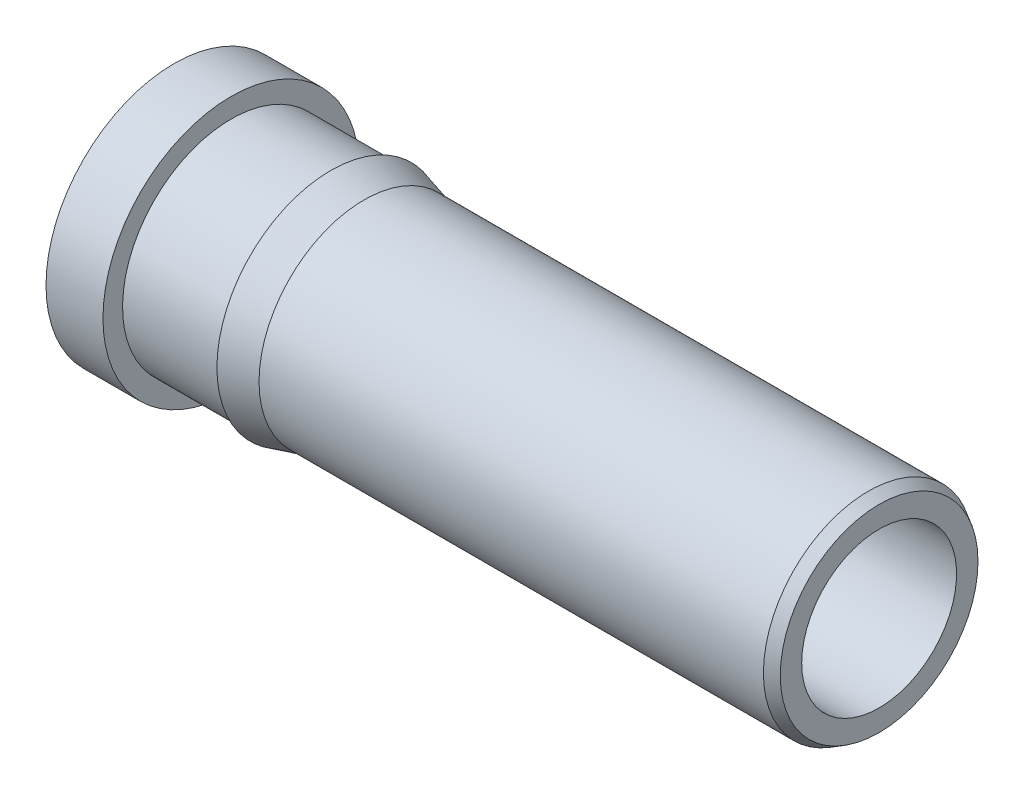
ISO-10303-21;
HEADER;
FILE_DESCRIPTION(('STEP AP214'),'2;1');
FILE_NAME('part.step','',(''),(''),'','','');
FILE_SCHEMA(('AUTOMOTIVE_DESIGN { 1 0 10303 214 1 1 1 1 }'));
ENDSEC;
DATA;
#1=APPLICATION_CONTEXT('core data for automotive mechanical design processes');
#2=APPLICATION_PROTOCOL_DEFINITION('international standard','automotive_design',2000,#1);
#3=PRODUCT_CONTEXT('',#1,'mechanical');
#4=PRODUCT('Part','Part','',(#3));
#5=PRODUCT_RELATED_PRODUCT_CATEGORY('part','',(#4));
#6=PRODUCT_DEFINITION_FORMATION('','',#4);
#7=PRODUCT_DEFINITION_CONTEXT('part definition',#1,'design');
#8=PRODUCT_DEFINITION('design','',#6,#7);
#9=PRODUCT_DEFINITION_SHAPE('','',#8);
#10=(LENGTH_UNIT() NAMED_UNIT(*) SI_UNIT(.MILLI.,.METRE.));
#11=(NAMED_UNIT(*) PLANE_ANGLE_UNIT() SI_UNIT($,.RADIAN.));
#12=(NAMED_UNIT(*) SI_UNIT($,.STERADIAN.) SOLID_ANGLE_UNIT());
#13=UNCERTAINTY_MEASURE_WITH_UNIT(LENGTH_MEASURE(1.E-05),#10,'distance_accuracy_value','');
#14=(GEOMETRIC_REPRESENTATION_CONTEXT(3) GLOBAL_UNCERTAINTY_ASSIGNED_CONTEXT((#13)) GLOBAL_UNIT_ASSIGNED_CONTEXT((#10,
#11,#12)) REPRESENTATION_CONTEXT('',''));
#15=CARTESIAN_POINT('',(0.,0.,0.));
#16=DIRECTION('',(0.,0.,1.));
#17=DIRECTION('',(1.,0.,0.));
#18=AXIS2_PLACEMENT_3D('',#15,#16,#17);
#19=CARTESIAN_POINT('',(1.1176,0.,0.));
#20=DIRECTION('',(-1.,0.,0.));
#21=DIRECTION('',(0.,-1.,0.));
#22=AXIS2_PLACEMENT_3D('',#19,#20,#21);
#23=CYLINDRICAL_SURFACE('',#22,0.7747);
#24=CARTESIAN_POINT('',(0.4064,0.,0.));
#25=DIRECTION('',(-1.,0.,0.));
#26=DIRECTION('',(0.,-1.,0.));
#27=AXIS2_PLACEMENT_3D('',#24,#25,#26);
#28=CIRCLE('',#27,0.7747);
#29=CARTESIAN_POINT('',(0.4064,-0.7747,0.));
#30=VERTEX_POINT('',#29);
#31=EDGE_CURVE('E53',#30,#30,#28,.F.);
#32=ORIENTED_EDGE('',*,*,#31,.T.);
#33=EDGE_LOOP('',(#32));
#34=FACE_BOUND('',#33,.T.);
#35=CARTESIAN_POINT('',(1.1176,0.,0.));
#36=DIRECTION('',(-1.,0.,0.));
#37=DIRECTION('',(0.,-1.,0.));
#38=AXIS2_PLACEMENT_3D('',#35,#36,#37);
#39=CIRCLE('',#38,0.7747);
#40=CARTESIAN_POINT('',(1.1176,-0.7747,0.));
#41=VERTEX_POINT('',#40);
#42=EDGE_CURVE('E19',#41,#41,#39,.T.);
#43=ORIENTED_EDGE('',*,*,#42,.T.);
#44=EDGE_LOOP('',(#43));
#45=FACE_BOUND('',#44,.T.);
#46=ADVANCED_FACE('F15',(#34,#45),#23,.T.);
#47=CARTESIAN_POINT('',(1.1176,-0.8225536,0.8225536));
#48=DIRECTION('',(1.,0.,0.));
#49=DIRECTION('',(0.,0.,-1.));
#50=AXIS2_PLACEMENT_3D('',#47,#48,#49);
#51=PLANE('',#50);
#52=ORIENTED_EDGE('',*,*,#42,.F.);
#53=EDGE_LOOP('',(#52));
#54=FACE_BOUND('',#53,.T.);
#55=CARTESIAN_POINT('',(1.11759999999994,0.,0.));
#56=DIRECTION('',(-1.,0.,0.));
#57=DIRECTION('',(0.,0.,1.));
#58=AXIS2_PLACEMENT_3D('',#55,#56,#57);
#59=CIRCLE('',#58,0.812800000000016);
#60=CARTESIAN_POINT('',(1.11759999999994,0.,0.812800000000016));
#61=VERTEX_POINT('',#60);
#62=EDGE_CURVE('E51',#61,#61,#59,.T.);
#63=ORIENTED_EDGE('',*,*,#62,.T.);
#64=EDGE_LOOP('',(#63));
#65=FACE_BOUND('',#64,.T.);
#66=ADVANCED_FACE('F61',(#54,#65),#51,.F.);
#67=CARTESIAN_POINT('',(0.4064,-0.9253728,-0.9253728));
#68=DIRECTION('',(-1.,0.,0.));
#69=DIRECTION('',(0.,0.,1.));
#70=AXIS2_PLACEMENT_3D('',#67,#68,#69);
#71=PLANE('',#70);
#72=ORIENTED_EDGE('',*,*,#31,.F.);
#73=EDGE_LOOP('',(#72));
#74=FACE_BOUND('',#73,.T.);
#75=CARTESIAN_POINT('',(0.4064,0.,0.));
#76=DIRECTION('',(-1.,0.,0.));
#77=DIRECTION('',(0.,-1.,0.));
#78=AXIS2_PLACEMENT_3D('',#75,#76,#77);
#79=CIRCLE('',#78,0.9144);
#80=CARTESIAN_POINT('',(0.4064,-0.9144,0.));
#81=VERTEX_POINT('',#80);
#82=EDGE_CURVE('E41',#81,#81,#79,.F.);
#83=ORIENTED_EDGE('',*,*,#82,.T.);
#84=EDGE_LOOP('',(#83));
#85=FACE_BOUND('',#84,.T.);
#86=ADVANCED_FACE('F64',(#74,#85),#71,.F.);
#87=CARTESIAN_POINT('',(1.3545852258,0.,0.));
#88=DIRECTION('',(-1.,0.,0.));
#89=DIRECTION('',(0.,0.,1.));
#90=AXIS2_PLACEMENT_3D('',#87,#88,#89);
#91=CONICAL_SURFACE('',#90,0.7493,0.261799388306168);
#92=ORIENTED_EDGE('',*,*,#62,.F.);
#93=EDGE_LOOP('',(#92));
#94=FACE_BOUND('',#93,.T.);
#95=CARTESIAN_POINT('',(1.3545852258,0.,0.));
#96=DIRECTION('',(-1.,0.,0.));
#97=DIRECTION('',(0.,0.,1.));
#98=AXIS2_PLACEMENT_3D('',#95,#96,#97);
#99=CIRCLE('',#98,0.7493);
#100=CARTESIAN_POINT('',(1.3545852258,0.,0.7493));
#101=VERTEX_POINT('',#100);
#102=EDGE_CURVE('E39',#101,#101,#99,.T.);
#103=ORIENTED_EDGE('',*,*,#102,.T.);
#104=EDGE_LOOP('',(#103));
#105=FACE_BOUND('',#104,.T.);
#106=ADVANCED_FACE('F68',(#94,#105),#91,.T.);
#107=CARTESIAN_POINT('',(0.4064,0.,0.));
#108=DIRECTION('',(-1.,0.,0.));
#109=DIRECTION('',(0.,-1.,0.));
#110=AXIS2_PLACEMENT_3D('',#107,#108,#109);
#111=CYLINDRICAL_SURFACE('',#110,0.9144);
#112=CARTESIAN_POINT('',(0.,0.,0.));
#113=DIRECTION('',(-1.,0.,0.));
#114=DIRECTION('',(0.,-1.,0.));
#115=AXIS2_PLACEMENT_3D('',#112,#113,#114);
#116=CIRCLE('',#115,0.9144);
#117=CARTESIAN_POINT('',(0.,-0.9144,0.));
#118=VERTEX_POINT('',#117);
#119=EDGE_CURVE('E38',#118,#118,#116,.F.);
#120=ORIENTED_EDGE('',*,*,#119,.T.);
#121=EDGE_LOOP('',(#120));
#122=FACE_BOUND('',#121,.T.);
#123=ORIENTED_EDGE('',*,*,#82,.F.);
#124=EDGE_LOOP('',(#123));
#125=FACE_BOUND('',#124,.T.);
#126=ADVANCED_FACE('F71',(#122,#125),#111,.T.);
#127=CARTESIAN_POINT('',(4.953,0.,0.));
#128=DIRECTION('',(-1.,0.,0.));
#129=DIRECTION('',(0.,0.,1.));
#130=AXIS2_PLACEMENT_3D('',#127,#128,#129);
#131=CYLINDRICAL_SURFACE('',#130,0.7493);
#132=ORIENTED_EDGE('',*,*,#102,.F.);
#133=EDGE_LOOP('',(#132));
#134=FACE_BOUND('',#133,.T.);
#135=CARTESIAN_POINT('',(4.95299999999999,0.,0.));
#136=DIRECTION('',(-1.,0.,0.));
#137=DIRECTION('',(0.,0.,1.));
#138=AXIS2_PLACEMENT_3D('',#135,#136,#137);
#139=CIRCLE('',#138,0.7493);
#140=CARTESIAN_POINT('',(4.953,0.,0.7493));
#141=VERTEX_POINT('',#140);
#142=EDGE_CURVE('E34',#141,#141,#139,.T.);
#143=ORIENTED_EDGE('',*,*,#142,.T.);
#144=EDGE_LOOP('',(#143));
#145=FACE_BOUND('',#144,.T.);
#146=ADVANCED_FACE('F75',(#134,#145),#131,.T.);
#147=CARTESIAN_POINT('',(0.,-0.9253728,0.9253728));
#148=DIRECTION('',(1.,0.,0.));
#149=DIRECTION('',(0.,0.,-1.));
#150=AXIS2_PLACEMENT_3D('',#147,#148,#149);
#151=PLANE('',#150);
#152=CARTESIAN_POINT('',(0.,0.,0.));
#153=DIRECTION('',(-1.,0.,0.));
#154=DIRECTION('',(0.,0.,1.));
#155=AXIS2_PLACEMENT_3D('',#152,#153,#154);
#156=CIRCLE('',#155,0.6477);
#157=CARTESIAN_POINT('',(0.,0.,0.6477));
#158=VERTEX_POINT('',#157);
#159=EDGE_CURVE('E37',#158,#158,#156,.T.);
#160=ORIENTED_EDGE('',*,*,#159,.F.);
#161=EDGE_LOOP('',(#160));
#162=FACE_BOUND('',#161,.T.);
#163=ORIENTED_EDGE('',*,*,#119,.F.);
#164=EDGE_LOOP('',(#163));
#165=FACE_BOUND('',#164,.T.);
#166=ADVANCED_FACE('F78',(#162,#165),#151,.F.);
#167=CARTESIAN_POINT('',(5.0292,0.,0.));
#168=DIRECTION('',(-1.,0.,0.));
#169=DIRECTION('',(0.,0.,1.));
#170=AXIS2_PLACEMENT_3D('',#167,#168,#169);
#171=CONICAL_SURFACE('',#170,0.7053059046,0.523598823706081);
#172=ORIENTED_EDGE('',*,*,#142,.F.);
#173=EDGE_LOOP('',(#172));
#174=FACE_BOUND('',#173,.T.);
#175=CARTESIAN_POINT('',(5.02919999999996,0.,0.));
#176=DIRECTION('',(-1.,0.,0.));
#177=DIRECTION('',(0.,0.,1.));
#178=AXIS2_PLACEMENT_3D('',#175,#176,#177);
#179=CIRCLE('',#178,0.705305904600026);
#180=CARTESIAN_POINT('',(5.02919999999996,0.,0.705305904600026));
#181=VERTEX_POINT('',#180);
#182=EDGE_CURVE('E33',#181,#181,#179,.T.);
#183=ORIENTED_EDGE('',*,*,#182,.T.);
#184=EDGE_LOOP('',(#183));
#185=FACE_BOUND('',#184,.T.);
#186=ADVANCED_FACE('F82',(#174,#185),#171,.T.);
#187=CARTESIAN_POINT('',(2.3368,0.,0.));
#188=DIRECTION('',(-1.,0.,0.));
#189=DIRECTION('',(0.,0.,1.));
#190=AXIS2_PLACEMENT_3D('',#187,#188,#189);
#191=CYLINDRICAL_SURFACE('',#190,0.6477);
#192=ORIENTED_EDGE('',*,*,#159,.T.);
#193=EDGE_LOOP('',(#192));
#194=FACE_BOUND('',#193,.T.);
#195=CARTESIAN_POINT('',(2.33680000000003,0.,0.));
#196=DIRECTION('',(-1.,0.,0.));
#197=DIRECTION('',(0.,0.,1.));
#198=AXIS2_PLACEMENT_3D('',#195,#196,#197);
#199=CIRCLE('',#198,0.6477);
#200=CARTESIAN_POINT('',(2.3368,0.,0.6477));
#201=VERTEX_POINT('',#200);
#202=EDGE_CURVE('E28',#201,#201,#199,.T.);
#203=ORIENTED_EDGE('',*,*,#202,.F.);
#204=EDGE_LOOP('',(#203));
#205=FACE_BOUND('',#204,.T.);
#206=ADVANCED_FACE('F85',(#194,#205),#191,.F.);
#207=CARTESIAN_POINT('',(5.0292,-0.713769591,-0.713769591));
#208=DIRECTION('',(-1.,0.,0.));
#209=DIRECTION('',(0.,0.,1.));
#210=AXIS2_PLACEMENT_3D('',#207,#208,#209);
#211=PLANE('',#210);
#212=CARTESIAN_POINT('',(5.0292,0.,0.));
#213=DIRECTION('',(-1.,0.,0.));
#214=DIRECTION('',(0.,0.,1.));
#215=AXIS2_PLACEMENT_3D('',#212,#213,#214);
#216=CIRCLE('',#215,0.55245);
#217=CARTESIAN_POINT('',(5.0292,0.,0.55245));
#218=VERTEX_POINT('',#217);
#219=EDGE_CURVE('E23',#218,#218,#216,.F.);
#220=ORIENTED_EDGE('',*,*,#219,.F.);
#221=EDGE_LOOP('',(#220));
#222=FACE_BOUND('',#221,.T.);
#223=ORIENTED_EDGE('',*,*,#182,.F.);
#224=EDGE_LOOP('',(#223));
#225=FACE_BOUND('',#224,.T.);
#226=ADVANCED_FACE('F17',(#222,#225),#211,.F.);
#227=CARTESIAN_POINT('',(2.3940319658,0.,0.));
#228=DIRECTION('',(-1.,0.,0.));
#229=DIRECTION('',(0.,0.,1.));
#230=AXIS2_PLACEMENT_3D('',#227,#228,#229);
#231=CONICAL_SURFACE('',#230,0.55245,1.02974432163927);
#232=ORIENTED_EDGE('',*,*,#202,.T.);
#233=EDGE_LOOP('',(#232));
#234=FACE_BOUND('',#233,.T.);
#235=CARTESIAN_POINT('',(2.3940319658,0.,0.));
#236=DIRECTION('',(-1.,0.,0.));
#237=DIRECTION('',(0.,0.,1.));
#238=AXIS2_PLACEMENT_3D('',#235,#236,#237);
#239=CIRCLE('',#238,0.55245);
#240=CARTESIAN_POINT('',(2.3940319658,0.,0.55245));
#241=VERTEX_POINT('',#240);
#242=EDGE_CURVE('E10',#241,#241,#239,.T.);
#243=ORIENTED_EDGE('',*,*,#242,.F.);
#244=EDGE_LOOP('',(#243));
#245=FACE_BOUND('',#244,.T.);
#246=ADVANCED_FACE('F90',(#234,#245),#231,.F.);
#247=CARTESIAN_POINT('',(5.0292,0.,0.));
#248=DIRECTION('',(-1.,0.,0.));
#249=DIRECTION('',(0.,0.,1.));
#250=AXIS2_PLACEMENT_3D('',#247,#248,#249);
#251=CYLINDRICAL_SURFACE('',#250,0.55245);
#252=ORIENTED_EDGE('',*,*,#242,.T.);
#253=EDGE_LOOP('',(#252));
#254=FACE_BOUND('',#253,.T.);
#255=ORIENTED_EDGE('',*,*,#219,.T.);
#256=EDGE_LOOP('',(#255));
#257=FACE_BOUND('',#256,.T.);
#258=ADVANCED_FACE('F97',(#254,#257),#251,.F.);
#259=CLOSED_SHELL('',(#46,#66,#86,#106,#126,#146,#166,#186,#206,#226,#246,#258));
#260=MANIFOLD_SOLID_BREP('B1',#259);
#261=ADVANCED_BREP_SHAPE_REPRESENTATION('',(#18,#260),#14);
#262=SHAPE_DEFINITION_REPRESENTATION(#9,#261);
ENDSEC;
END-ISO-10303-21;
